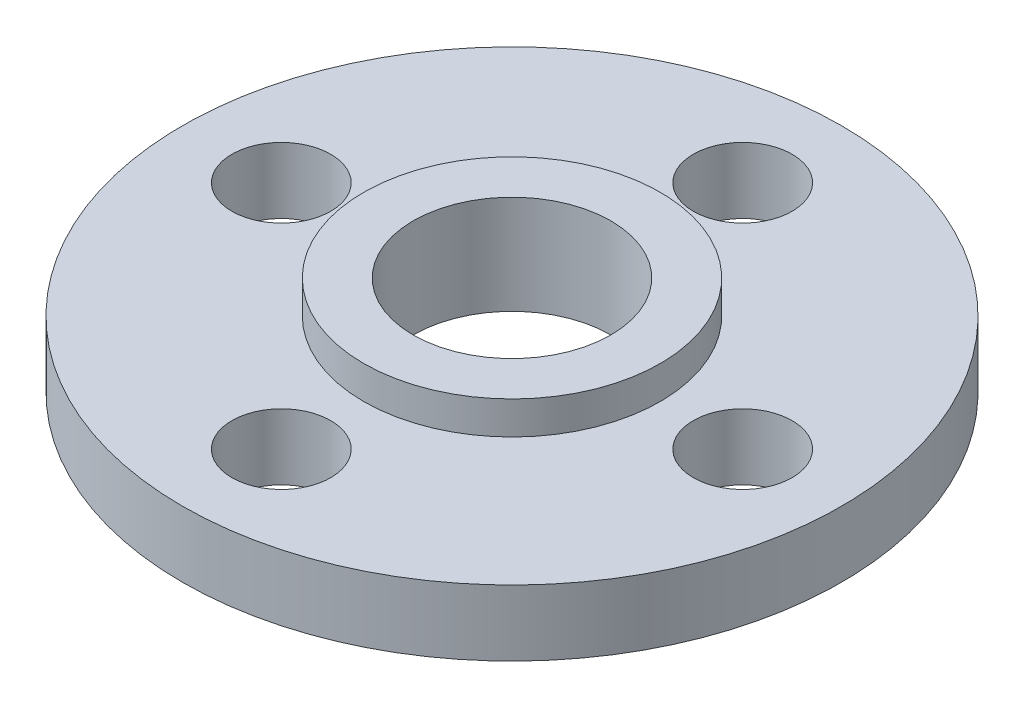
ISO-10303-21;
HEADER;
FILE_DESCRIPTION(('STEP AP214'),'2;1');
FILE_NAME('part.step','',(''),(''),'','','');
FILE_SCHEMA(('AUTOMOTIVE_DESIGN { 1 0 10303 214 1 1 1 1 }'));
ENDSEC;
DATA;
#1=APPLICATION_CONTEXT('core data for automotive mechanical design processes');
#2=APPLICATION_PROTOCOL_DEFINITION('international standard','automotive_design',2000,#1);
#3=PRODUCT_CONTEXT('',#1,'mechanical');
#4=PRODUCT('Part','Part','',(#3));
#5=PRODUCT_RELATED_PRODUCT_CATEGORY('part','',(#4));
#6=PRODUCT_DEFINITION_FORMATION('','',#4);
#7=PRODUCT_DEFINITION_CONTEXT('part definition',#1,'design');
#8=PRODUCT_DEFINITION('design','',#6,#7);
#9=PRODUCT_DEFINITION_SHAPE('','',#8);
#10=(LENGTH_UNIT() NAMED_UNIT(*) SI_UNIT(.MILLI.,.METRE.));
#11=(NAMED_UNIT(*) PLANE_ANGLE_UNIT() SI_UNIT($,.RADIAN.));
#12=(NAMED_UNIT(*) SI_UNIT($,.STERADIAN.) SOLID_ANGLE_UNIT());
#13=UNCERTAINTY_MEASURE_WITH_UNIT(LENGTH_MEASURE(1.E-05),#10,'distance_accuracy_value','');
#14=(GEOMETRIC_REPRESENTATION_CONTEXT(3) GLOBAL_UNCERTAINTY_ASSIGNED_CONTEXT((#13)) GLOBAL_UNIT_ASSIGNED_CONTEXT((#10,
#11,#12)) REPRESENTATION_CONTEXT('',''));
#15=CARTESIAN_POINT('',(0.,0.,0.));
#16=DIRECTION('',(0.,0.,1.));
#17=DIRECTION('',(1.,0.,0.));
#18=AXIS2_PLACEMENT_3D('',#15,#16,#17);
#19=CARTESIAN_POINT('',(0.,2.,0.));
#20=DIRECTION('',(0.,1.,0.));
#21=DIRECTION('',(0.,0.,1.));
#22=AXIS2_PLACEMENT_3D('',#19,#20,#21);
#23=PLANE('',#22);
#24=CARTESIAN_POINT('',(0.,2.,0.));
#25=DIRECTION('',(0.,1.,0.));
#26=DIRECTION('',(0.,0.,1.));
#27=AXIS2_PLACEMENT_3D('',#24,#25,#26);
#28=CIRCLE('',#27,10.);
#29=CARTESIAN_POINT('',(0.,2.,10.));
#30=VERTEX_POINT('',#29);
#31=EDGE_CURVE('E10',#30,#30,#28,.T.);
#32=ORIENTED_EDGE('',*,*,#31,.T.);
#33=EDGE_LOOP('',(#32));
#34=FACE_BOUND('',#33,.T.);
#35=CARTESIAN_POINT('',(0.,2.,-7.));
#36=DIRECTION('',(0.,1.,0.));
#37=DIRECTION('',(0.,0.,1.));
#38=AXIS2_PLACEMENT_3D('',#35,#36,#37);
#39=CIRCLE('',#38,1.5);
#40=CARTESIAN_POINT('',(0.,2.,-5.5));
#41=VERTEX_POINT('',#40);
#42=EDGE_CURVE('E57',#41,#41,#39,.T.);
#43=ORIENTED_EDGE('',*,*,#42,.F.);
#44=EDGE_LOOP('',(#43));
#45=FACE_BOUND('',#44,.T.);
#46=CARTESIAN_POINT('',(7.,2.,0.));
#47=DIRECTION('',(0.,1.,0.));
#48=DIRECTION('',(0.,0.,1.));
#49=AXIS2_PLACEMENT_3D('',#46,#47,#48);
#50=CIRCLE('',#49,1.5);
#51=CARTESIAN_POINT('',(7.,2.,1.5));
#52=VERTEX_POINT('',#51);
#53=EDGE_CURVE('E50',#52,#52,#50,.T.);
#54=ORIENTED_EDGE('',*,*,#53,.F.);
#55=EDGE_LOOP('',(#54));
#56=FACE_BOUND('',#55,.T.);
#57=CARTESIAN_POINT('',(0.,2.,7.));
#58=DIRECTION('',(0.,1.,0.));
#59=DIRECTION('',(0.,0.,1.));
#60=AXIS2_PLACEMENT_3D('',#57,#58,#59);
#61=CIRCLE('',#60,1.5);
#62=CARTESIAN_POINT('',(0.,2.,8.5));
#63=VERTEX_POINT('',#62);
#64=EDGE_CURVE('E69',#63,#63,#61,.T.);
#65=ORIENTED_EDGE('',*,*,#64,.F.);
#66=EDGE_LOOP('',(#65));
#67=FACE_BOUND('',#66,.T.);
#68=CARTESIAN_POINT('',(-7.,2.,0.));
#69=DIRECTION('',(0.,1.,0.));
#70=DIRECTION('',(0.,0.,1.));
#71=AXIS2_PLACEMENT_3D('',#68,#69,#70);
#72=CIRCLE('',#71,1.5);
#73=CARTESIAN_POINT('',(-7.,2.,1.5));
#74=VERTEX_POINT('',#73);
#75=EDGE_CURVE('E62',#74,#74,#72,.T.);
#76=ORIENTED_EDGE('',*,*,#75,.F.);
#77=EDGE_LOOP('',(#76));
#78=FACE_BOUND('',#77,.T.);
#79=CARTESIAN_POINT('',(0.,2.,0.));
#80=DIRECTION('',(0.,1.,0.));
#81=DIRECTION('',(0.,0.,1.));
#82=AXIS2_PLACEMENT_3D('',#79,#80,#81);
#83=CIRCLE('',#82,4.5);
#84=CARTESIAN_POINT('',(0.,2.,4.5));
#85=VERTEX_POINT('',#84);
#86=EDGE_CURVE('E74',#85,#85,#83,.T.);
#87=ORIENTED_EDGE('',*,*,#86,.F.);
#88=EDGE_LOOP('',(#87));
#89=FACE_BOUND('',#88,.T.);
#90=ADVANCED_FACE('F34',(#34,#45,#56,#67,#78,#89),#23,.T.);
#91=CARTESIAN_POINT('',(0.,2.,0.));
#92=DIRECTION('',(0.,-1.,0.));
#93=DIRECTION('',(0.,0.,-1.));
#94=AXIS2_PLACEMENT_3D('',#91,#92,#93);
#95=CYLINDRICAL_SURFACE('',#94,10.);
#96=ORIENTED_EDGE('',*,*,#31,.F.);
#97=EDGE_LOOP('',(#96));
#98=FACE_BOUND('',#97,.T.);
#99=CARTESIAN_POINT('',(0.,0.,0.));
#100=DIRECTION('',(0.,1.,0.));
#101=DIRECTION('',(0.,0.,1.));
#102=AXIS2_PLACEMENT_3D('',#99,#100,#101);
#103=CIRCLE('',#102,10.);
#104=CARTESIAN_POINT('',(0.,0.,10.));
#105=VERTEX_POINT('',#104);
#106=EDGE_CURVE('E38',#105,#105,#103,.T.);
#107=ORIENTED_EDGE('',*,*,#106,.T.);
#108=EDGE_LOOP('',(#107));
#109=FACE_BOUND('',#108,.T.);
#110=ADVANCED_FACE('F36',(#98,#109),#95,.T.);
#111=CARTESIAN_POINT('',(0.,0.,0.));
#112=DIRECTION('',(0.,1.,0.));
#113=DIRECTION('',(0.,0.,1.));
#114=AXIS2_PLACEMENT_3D('',#111,#112,#113);
#115=PLANE('',#114);
#116=CARTESIAN_POINT('',(-7.,0.,0.));
#117=DIRECTION('',(0.,1.,0.));
#118=DIRECTION('',(0.,0.,1.));
#119=AXIS2_PLACEMENT_3D('',#116,#117,#118);
#120=CIRCLE('',#119,1.5);
#121=CARTESIAN_POINT('',(-7.,0.,1.5));
#122=VERTEX_POINT('',#121);
#123=EDGE_CURVE('E65',#122,#122,#120,.T.);
#124=ORIENTED_EDGE('',*,*,#123,.T.);
#125=EDGE_LOOP('',(#124));
#126=FACE_BOUND('',#125,.T.);
#127=CARTESIAN_POINT('',(0.,0.,7.));
#128=DIRECTION('',(0.,1.,0.));
#129=DIRECTION('',(0.,0.,1.));
#130=AXIS2_PLACEMENT_3D('',#127,#128,#129);
#131=CIRCLE('',#130,1.5);
#132=CARTESIAN_POINT('',(0.,0.,8.5));
#133=VERTEX_POINT('',#132);
#134=EDGE_CURVE('E54',#133,#133,#131,.T.);
#135=ORIENTED_EDGE('',*,*,#134,.T.);
#136=EDGE_LOOP('',(#135));
#137=FACE_BOUND('',#136,.T.);
#138=CARTESIAN_POINT('',(7.,0.,0.));
#139=DIRECTION('',(0.,1.,0.));
#140=DIRECTION('',(0.,0.,1.));
#141=AXIS2_PLACEMENT_3D('',#138,#139,#140);
#142=CIRCLE('',#141,1.5);
#143=CARTESIAN_POINT('',(7.,0.,1.5));
#144=VERTEX_POINT('',#143);
#145=EDGE_CURVE('E53',#144,#144,#142,.T.);
#146=ORIENTED_EDGE('',*,*,#145,.T.);
#147=EDGE_LOOP('',(#146));
#148=FACE_BOUND('',#147,.T.);
#149=CARTESIAN_POINT('',(0.,0.,-7.));
#150=DIRECTION('',(0.,1.,0.));
#151=DIRECTION('',(0.,0.,1.));
#152=AXIS2_PLACEMENT_3D('',#149,#150,#151);
#153=CIRCLE('',#152,1.5);
#154=CARTESIAN_POINT('',(0.,0.,-5.5));
#155=VERTEX_POINT('',#154);
#156=EDGE_CURVE('E49',#155,#155,#153,.T.);
#157=ORIENTED_EDGE('',*,*,#156,.T.);
#158=EDGE_LOOP('',(#157));
#159=FACE_BOUND('',#158,.T.);
#160=CARTESIAN_POINT('',(0.,0.,0.));
#161=DIRECTION('',(0.,1.,0.));
#162=DIRECTION('',(0.,0.,1.));
#163=AXIS2_PLACEMENT_3D('',#160,#161,#162);
#164=CIRCLE('',#163,3.);
#165=CARTESIAN_POINT('',(0.,0.,3.));
#166=VERTEX_POINT('',#165);
#167=EDGE_CURVE('E45',#166,#166,#164,.T.);
#168=ORIENTED_EDGE('',*,*,#167,.T.);
#169=EDGE_LOOP('',(#168));
#170=FACE_BOUND('',#169,.T.);
#171=ORIENTED_EDGE('',*,*,#106,.F.);
#172=EDGE_LOOP('',(#171));
#173=FACE_BOUND('',#172,.T.);
#174=ADVANCED_FACE('F105',(#126,#137,#148,#159,#170,#173),#115,.F.);
#175=CARTESIAN_POINT('',(0.,0.,0.));
#176=DIRECTION('',(0.,1.,0.));
#177=DIRECTION('',(0.,0.,1.));
#178=AXIS2_PLACEMENT_3D('',#175,#176,#177);
#179=CYLINDRICAL_SURFACE('',#178,3.);
#180=ORIENTED_EDGE('',*,*,#167,.F.);
#181=EDGE_LOOP('',(#180));
#182=FACE_BOUND('',#181,.T.);
#183=CARTESIAN_POINT('',(0.,3.,0.));
#184=DIRECTION('',(0.,1.,0.));
#185=DIRECTION('',(0.,0.,1.));
#186=AXIS2_PLACEMENT_3D('',#183,#184,#185);
#187=CIRCLE('',#186,3.);
#188=CARTESIAN_POINT('',(0.,3.,3.));
#189=VERTEX_POINT('',#188);
#190=EDGE_CURVE('E77',#189,#189,#187,.T.);
#191=ORIENTED_EDGE('',*,*,#190,.T.);
#192=EDGE_LOOP('',(#191));
#193=FACE_BOUND('',#192,.T.);
#194=ADVANCED_FACE('F83',(#182,#193),#179,.F.);
#195=CARTESIAN_POINT('',(0.,0.,-7.));
#196=DIRECTION('',(0.,1.,0.));
#197=DIRECTION('',(0.,0.,1.));
#198=AXIS2_PLACEMENT_3D('',#195,#196,#197);
#199=CYLINDRICAL_SURFACE('',#198,1.5);
#200=ORIENTED_EDGE('',*,*,#156,.F.);
#201=EDGE_LOOP('',(#200));
#202=FACE_BOUND('',#201,.T.);
#203=ORIENTED_EDGE('',*,*,#42,.T.);
#204=EDGE_LOOP('',(#203));
#205=FACE_BOUND('',#204,.T.);
#206=ADVANCED_FACE('F115',(#202,#205),#199,.F.);
#207=CARTESIAN_POINT('',(7.,0.,0.));
#208=DIRECTION('',(0.,1.,0.));
#209=DIRECTION('',(0.,0.,1.));
#210=AXIS2_PLACEMENT_3D('',#207,#208,#209);
#211=CYLINDRICAL_SURFACE('',#210,1.5);
#212=ORIENTED_EDGE('',*,*,#145,.F.);
#213=EDGE_LOOP('',(#212));
#214=FACE_BOUND('',#213,.T.);
#215=ORIENTED_EDGE('',*,*,#53,.T.);
#216=EDGE_LOOP('',(#215));
#217=FACE_BOUND('',#216,.T.);
#218=ADVANCED_FACE('F132',(#214,#217),#211,.F.);
#219=CARTESIAN_POINT('',(0.,0.,7.));
#220=DIRECTION('',(0.,1.,0.));
#221=DIRECTION('',(0.,0.,1.));
#222=AXIS2_PLACEMENT_3D('',#219,#220,#221);
#223=CYLINDRICAL_SURFACE('',#222,1.5);
#224=ORIENTED_EDGE('',*,*,#134,.F.);
#225=EDGE_LOOP('',(#224));
#226=FACE_BOUND('',#225,.T.);
#227=ORIENTED_EDGE('',*,*,#64,.T.);
#228=EDGE_LOOP('',(#227));
#229=FACE_BOUND('',#228,.T.);
#230=ADVANCED_FACE('F97',(#226,#229),#223,.F.);
#231=CARTESIAN_POINT('',(-7.,0.,0.));
#232=DIRECTION('',(0.,1.,0.));
#233=DIRECTION('',(0.,0.,1.));
#234=AXIS2_PLACEMENT_3D('',#231,#232,#233);
#235=CYLINDRICAL_SURFACE('',#234,1.5);
#236=ORIENTED_EDGE('',*,*,#123,.F.);
#237=EDGE_LOOP('',(#236));
#238=FACE_BOUND('',#237,.T.);
#239=ORIENTED_EDGE('',*,*,#75,.T.);
#240=EDGE_LOOP('',(#239));
#241=FACE_BOUND('',#240,.T.);
#242=ADVANCED_FACE('F88',(#238,#241),#235,.F.);
#243=CARTESIAN_POINT('',(0.,3.,0.));
#244=DIRECTION('',(0.,1.,0.));
#245=DIRECTION('',(0.,0.,1.));
#246=AXIS2_PLACEMENT_3D('',#243,#244,#245);
#247=PLANE('',#246);
#248=CARTESIAN_POINT('',(0.,3.,0.));
#249=DIRECTION('',(0.,1.,0.));
#250=DIRECTION('',(0.,0.,1.));
#251=AXIS2_PLACEMENT_3D('',#248,#249,#250);
#252=CIRCLE('',#251,4.5);
#253=CARTESIAN_POINT('',(0.,3.,4.5));
#254=VERTEX_POINT('',#253);
#255=EDGE_CURVE('E66',#254,#254,#252,.T.);
#256=ORIENTED_EDGE('',*,*,#255,.T.);
#257=EDGE_LOOP('',(#256));
#258=FACE_BOUND('',#257,.T.);
#259=ORIENTED_EDGE('',*,*,#190,.F.);
#260=EDGE_LOOP('',(#259));
#261=FACE_BOUND('',#260,.T.);
#262=ADVANCED_FACE('F85',(#258,#261),#247,.T.);
#263=CARTESIAN_POINT('',(0.,3.,0.));
#264=DIRECTION('',(0.,-1.,0.));
#265=DIRECTION('',(0.,0.,-1.));
#266=AXIS2_PLACEMENT_3D('',#263,#264,#265);
#267=CYLINDRICAL_SURFACE('',#266,4.5);
#268=ORIENTED_EDGE('',*,*,#255,.F.);
#269=EDGE_LOOP('',(#268));
#270=FACE_BOUND('',#269,.T.);
#271=ORIENTED_EDGE('',*,*,#86,.T.);
#272=EDGE_LOOP('',(#271));
#273=FACE_BOUND('',#272,.T.);
#274=ADVANCED_FACE('F87',(#270,#273),#267,.T.);
#275=CLOSED_SHELL('',(#90,#110,#174,#194,#206,#218,#230,#242,#262,#274));
#276=MANIFOLD_SOLID_BREP('B2',#275);
#277=ADVANCED_BREP_SHAPE_REPRESENTATION('',(#18,#276),#14);
#278=SHAPE_DEFINITION_REPRESENTATION(#9,#277);
ENDSEC;
END-ISO-10303-21;
